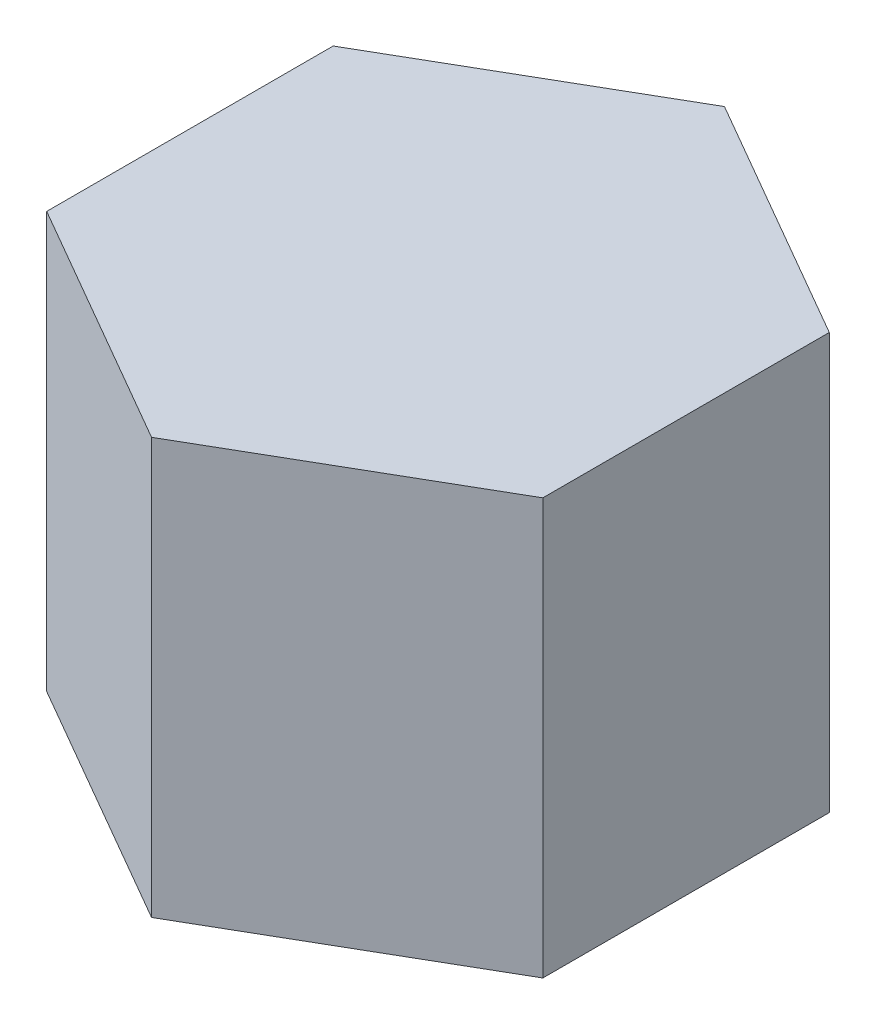
ISO-10303-21;
HEADER;
FILE_DESCRIPTION(('STEP AP214'),'2;1');
FILE_NAME('part.step','',(''),(''),'','','');
FILE_SCHEMA(('AUTOMOTIVE_DESIGN { 1 0 10303 214 1 1 1 1 }'));
ENDSEC;
DATA;
#1=APPLICATION_CONTEXT('core data for automotive mechanical design processes');
#2=APPLICATION_PROTOCOL_DEFINITION('international standard','automotive_design',2000,#1);
#3=PRODUCT_CONTEXT('',#1,'mechanical');
#4=PRODUCT('Part','Part','',(#3));
#5=PRODUCT_RELATED_PRODUCT_CATEGORY('part','',(#4));
#6=PRODUCT_DEFINITION_FORMATION('','',#4);
#7=PRODUCT_DEFINITION_CONTEXT('part definition',#1,'design');
#8=PRODUCT_DEFINITION('design','',#6,#7);
#9=PRODUCT_DEFINITION_SHAPE('','',#8);
#10=(LENGTH_UNIT() NAMED_UNIT(*) SI_UNIT(.MILLI.,.METRE.));
#11=(NAMED_UNIT(*) PLANE_ANGLE_UNIT() SI_UNIT($,.RADIAN.));
#12=(NAMED_UNIT(*) SI_UNIT($,.STERADIAN.) SOLID_ANGLE_UNIT());
#13=UNCERTAINTY_MEASURE_WITH_UNIT(LENGTH_MEASURE(1.E-05),#10,'distance_accuracy_value','');
#14=(GEOMETRIC_REPRESENTATION_CONTEXT(3) GLOBAL_UNCERTAINTY_ASSIGNED_CONTEXT((#13)) GLOBAL_UNIT_ASSIGNED_CONTEXT((#10,
#11,#12)) REPRESENTATION_CONTEXT('',''));
#15=CARTESIAN_POINT('',(0.,0.,0.));
#16=DIRECTION('',(0.,0.,1.));
#17=DIRECTION('',(1.,0.,0.));
#18=AXIS2_PLACEMENT_3D('',#15,#16,#17);
#19=CARTESIAN_POINT('',(204.142660308706,-148.537700895744,290.64094581671));
#20=DIRECTION('',(-0.499999999999909,0.,-0.866025403784491));
#21=DIRECTION('',(-0.866025403784491,0.,0.499999999999909));
#22=AXIS2_PLACEMENT_3D('',#19,#20,#21);
#23=PLANE('',#22);
#24=CARTESIAN_POINT('',(203.839551417382,-149.045793579175,290.81594581671));
#25=DIRECTION('',(0.866025403784491,0.,-0.499999999999909));
#26=VECTOR('',#25,1.);
#27=LINE('',#24,#26);
#28=CARTESIAN_POINT('',(203.839551417382,-149.045793579175,290.81594581671));
#29=VERTEX_POINT('',#28);
#30=CARTESIAN_POINT('',(204.142660308706,-149.045793579175,290.64094581671));
#31=VERTEX_POINT('',#30);
#32=EDGE_CURVE('E170',#29,#31,#27,.T.);
#33=ORIENTED_EDGE('',*,*,#32,.T.);
#34=CARTESIAN_POINT('',(204.142660308706,-148.537700895744,290.64094581671));
#35=DIRECTION('',(0.,-1.,0.));
#36=VECTOR('',#35,1.);
#37=LINE('',#34,#36);
#38=CARTESIAN_POINT('',(204.142660308706,-148.537700895744,290.64094581671));
#39=VERTEX_POINT('',#38);
#40=EDGE_CURVE('E35',#39,#31,#37,.T.);
#41=ORIENTED_EDGE('',*,*,#40,.F.);
#42=CARTESIAN_POINT('',(203.839551417382,-148.537700895744,290.81594581671));
#43=DIRECTION('',(0.866025403784491,0.,-0.499999999999909));
#44=VECTOR('',#43,1.);
#45=LINE('',#42,#44);
#46=CARTESIAN_POINT('',(203.839551417382,-148.537700895744,290.81594581671));
#47=VERTEX_POINT('',#46);
#48=EDGE_CURVE('E159',#47,#39,#45,.T.);
#49=ORIENTED_EDGE('',*,*,#48,.F.);
#50=CARTESIAN_POINT('',(203.839551417382,-148.537700895744,290.81594581671));
#51=DIRECTION('',(0.,-1.,0.));
#52=VECTOR('',#51,1.);
#53=LINE('',#50,#52);
#54=EDGE_CURVE('E10',#47,#29,#53,.T.);
#55=ORIENTED_EDGE('',*,*,#54,.T.);
#56=EDGE_LOOP('',(#33,#41,#49,#55));
#57=FACE_BOUND('',#56,.T.);
#58=ADVANCED_FACE('F16',(#57),#23,.F.);
#59=CARTESIAN_POINT('',(203.839551417382,-148.537700895744,290.81594581671));
#60=DIRECTION('',(0.500000000000062,0.,-0.866025403784403));
#61=DIRECTION('',(-0.866025403784403,0.,-0.500000000000062));
#62=AXIS2_PLACEMENT_3D('',#59,#60,#61);
#63=PLANE('',#62);
#64=CARTESIAN_POINT('',(203.536442526057,-149.045793579175,290.64094581671));
#65=DIRECTION('',(0.866025403784403,0.,0.500000000000062));
#66=VECTOR('',#65,1.);
#67=LINE('',#64,#66);
#68=CARTESIAN_POINT('',(203.536442526057,-149.045793579175,290.64094581671));
#69=VERTEX_POINT('',#68);
#70=EDGE_CURVE('E167',#69,#29,#67,.T.);
#71=ORIENTED_EDGE('',*,*,#70,.T.);
#72=ORIENTED_EDGE('',*,*,#54,.F.);
#73=CARTESIAN_POINT('',(203.536442526057,-148.537700895744,290.64094581671));
#74=DIRECTION('',(0.866025403784403,0.,0.500000000000062));
#75=VECTOR('',#74,1.);
#76=LINE('',#73,#75);
#77=CARTESIAN_POINT('',(203.536442526057,-148.537700895744,290.64094581671));
#78=VERTEX_POINT('',#77);
#79=EDGE_CURVE('E156',#78,#47,#76,.T.);
#80=ORIENTED_EDGE('',*,*,#79,.F.);
#81=CARTESIAN_POINT('',(203.536442526057,-148.537700895744,290.64094581671));
#82=DIRECTION('',(0.,-1.,0.));
#83=VECTOR('',#82,1.);
#84=LINE('',#81,#83);
#85=EDGE_CURVE('E27',#78,#69,#84,.T.);
#86=ORIENTED_EDGE('',*,*,#85,.T.);
#87=EDGE_LOOP('',(#71,#72,#80,#86));
#88=FACE_BOUND('',#87,.T.);
#89=ADVANCED_FACE('F189',(#88),#63,.F.);
#90=CARTESIAN_POINT('',(203.536442526057,-148.537700895744,290.831971220494));
#91=DIRECTION('',(1.,0.,0.));
#92=DIRECTION('',(0.,1.,0.));
#93=AXIS2_PLACEMENT_3D('',#90,#91,#92);
#94=PLANE('',#93);
#95=CARTESIAN_POINT('',(203.536442526057,-149.045793579175,290.29094581671));
#96=DIRECTION('',(0.,0.,1.));
#97=VECTOR('',#96,1.);
#98=LINE('',#95,#97);
#99=CARTESIAN_POINT('',(203.536442526057,-149.045793579175,290.29094581671));
#100=VERTEX_POINT('',#99);
#101=EDGE_CURVE('E163',#100,#69,#98,.T.);
#102=ORIENTED_EDGE('',*,*,#101,.T.);
#103=ORIENTED_EDGE('',*,*,#85,.F.);
#104=CARTESIAN_POINT('',(203.536442526057,-148.537700895744,290.29094581671));
#105=DIRECTION('',(0.,0.,1.));
#106=VECTOR('',#105,1.);
#107=LINE('',#104,#106);
#108=CARTESIAN_POINT('',(203.536442526057,-148.537700895744,290.29094581671));
#109=VERTEX_POINT('',#108);
#110=EDGE_CURVE('E106',#109,#78,#107,.T.);
#111=ORIENTED_EDGE('',*,*,#110,.F.);
#112=CARTESIAN_POINT('',(203.536442526057,-148.537700895744,290.29094581671));
#113=DIRECTION('',(0.,-1.,0.));
#114=VECTOR('',#113,1.);
#115=LINE('',#112,#114);
#116=EDGE_CURVE('E94',#109,#100,#115,.T.);
#117=ORIENTED_EDGE('',*,*,#116,.T.);
#118=EDGE_LOOP('',(#102,#103,#111,#117));
#119=FACE_BOUND('',#118,.T.);
#120=ADVANCED_FACE('F198',(#119),#94,.F.);
#121=CARTESIAN_POINT('',(203.536442526057,-148.537700895744,290.29094581671));
#122=DIRECTION('',(0.499999999999943,0.,0.866025403784472));
#123=DIRECTION('',(0.866025403784472,0.,-0.499999999999943));
#124=AXIS2_PLACEMENT_3D('',#121,#122,#123);
#125=PLANE('',#124);
#126=CARTESIAN_POINT('',(203.839551417382,-149.045793579175,290.11594581671));
#127=DIRECTION('',(-0.866025403784471,0.,0.499999999999943));
#128=VECTOR('',#127,1.);
#129=LINE('',#126,#128);
#130=CARTESIAN_POINT('',(203.839551417382,-149.045793579175,290.11594581671));
#131=VERTEX_POINT('',#130);
#132=EDGE_CURVE('E162',#131,#100,#129,.T.);
#133=ORIENTED_EDGE('',*,*,#132,.T.);
#134=ORIENTED_EDGE('',*,*,#116,.F.);
#135=CARTESIAN_POINT('',(203.839551417382,-148.537700895744,290.11594581671));
#136=DIRECTION('',(-0.866025403784471,0.,0.499999999999943));
#137=VECTOR('',#136,1.);
#138=LINE('',#135,#137);
#139=CARTESIAN_POINT('',(203.839551417382,-148.537700895744,290.11594581671));
#140=VERTEX_POINT('',#139);
#141=EDGE_CURVE('E98',#140,#109,#138,.T.);
#142=ORIENTED_EDGE('',*,*,#141,.F.);
#143=CARTESIAN_POINT('',(203.839551417382,-148.537700895744,290.11594581671));
#144=DIRECTION('',(0.,-1.,0.));
#145=VECTOR('',#144,1.);
#146=LINE('',#143,#145);
#147=EDGE_CURVE('E79',#140,#131,#146,.T.);
#148=ORIENTED_EDGE('',*,*,#147,.T.);
#149=EDGE_LOOP('',(#133,#134,#142,#148));
#150=FACE_BOUND('',#149,.T.);
#151=ADVANCED_FACE('F100',(#150),#125,.F.);
#152=CARTESIAN_POINT('',(203.839551417381,-148.537700895744,290.11594581671));
#153=DIRECTION('',(-0.500000000000062,0.,0.866025403784403));
#154=DIRECTION('',(0.866025403784403,0.,0.500000000000062));
#155=AXIS2_PLACEMENT_3D('',#152,#153,#154);
#156=PLANE('',#155);
#157=CARTESIAN_POINT('',(204.142660308706,-149.045793579175,290.29094581671));
#158=DIRECTION('',(-0.866025403784403,0.,-0.500000000000062));
#159=VECTOR('',#158,1.);
#160=LINE('',#157,#159);
#161=CARTESIAN_POINT('',(204.142660308706,-149.045793579175,290.29094581671));
#162=VERTEX_POINT('',#161);
#163=EDGE_CURVE('E88',#162,#131,#160,.T.);
#164=ORIENTED_EDGE('',*,*,#163,.T.);
#165=ORIENTED_EDGE('',*,*,#147,.F.);
#166=CARTESIAN_POINT('',(204.142660308706,-148.537700895744,290.29094581671));
#167=DIRECTION('',(-0.866025403784403,0.,-0.500000000000062));
#168=VECTOR('',#167,1.);
#169=LINE('',#166,#168);
#170=CARTESIAN_POINT('',(204.142660308706,-148.537700895744,290.29094581671));
#171=VERTEX_POINT('',#170);
#172=EDGE_CURVE('E84',#171,#140,#169,.T.);
#173=ORIENTED_EDGE('',*,*,#172,.F.);
#174=CARTESIAN_POINT('',(204.142660308706,-148.537700895744,290.29094581671));
#175=DIRECTION('',(0.,-1.,0.));
#176=VECTOR('',#175,1.);
#177=LINE('',#174,#176);
#178=EDGE_CURVE('E58',#171,#162,#177,.T.);
#179=ORIENTED_EDGE('',*,*,#178,.T.);
#180=EDGE_LOOP('',(#164,#165,#173,#179));
#181=FACE_BOUND('',#180,.T.);
#182=ADVANCED_FACE('F82',(#181),#156,.F.);
#183=CARTESIAN_POINT('',(204.142660308706,-148.537700895744,290.831971220494));
#184=DIRECTION('',(-1.,0.,0.));
#185=DIRECTION('',(0.,-1.,0.));
#186=AXIS2_PLACEMENT_3D('',#183,#184,#185);
#187=PLANE('',#186);
#188=CARTESIAN_POINT('',(204.142660308706,-149.045793579175,290.64094581671));
#189=DIRECTION('',(0.,0.,-1.));
#190=VECTOR('',#189,1.);
#191=LINE('',#188,#190);
#192=EDGE_CURVE('E160',#31,#162,#191,.T.);
#193=ORIENTED_EDGE('',*,*,#192,.T.);
#194=ORIENTED_EDGE('',*,*,#178,.F.);
#195=CARTESIAN_POINT('',(204.142660308706,-148.537700895744,290.64094581671));
#196=DIRECTION('',(0.,0.,-1.));
#197=VECTOR('',#196,1.);
#198=LINE('',#195,#197);
#199=EDGE_CURVE('E112',#39,#171,#198,.T.);
#200=ORIENTED_EDGE('',*,*,#199,.F.);
#201=ORIENTED_EDGE('',*,*,#40,.T.);
#202=EDGE_LOOP('',(#193,#194,#200,#201));
#203=FACE_BOUND('',#202,.T.);
#204=ADVANCED_FACE('F131',(#203),#187,.F.);
#205=CARTESIAN_POINT('',(206.339551417382,-148.537700895744,290.831971220494));
#206=DIRECTION('',(0.,-1.,0.));
#207=DIRECTION('',(1.,0.,0.));
#208=AXIS2_PLACEMENT_3D('',#205,#206,#207);
#209=PLANE('',#208);
#210=ORIENTED_EDGE('',*,*,#48,.T.);
#211=ORIENTED_EDGE('',*,*,#199,.T.);
#212=ORIENTED_EDGE('',*,*,#172,.T.);
#213=ORIENTED_EDGE('',*,*,#141,.T.);
#214=ORIENTED_EDGE('',*,*,#110,.T.);
#215=ORIENTED_EDGE('',*,*,#79,.T.);
#216=EDGE_LOOP('',(#210,#211,#212,#213,#214,#215));
#217=FACE_BOUND('',#216,.T.);
#218=ADVANCED_FACE('F111',(#217),#209,.F.);
#219=CARTESIAN_POINT('',(206.339551417382,-149.045793579175,290.831971220494));
#220=DIRECTION('',(0.,-1.,0.));
#221=DIRECTION('',(1.,0.,0.));
#222=AXIS2_PLACEMENT_3D('',#219,#220,#221);
#223=PLANE('',#222);
#224=ORIENTED_EDGE('',*,*,#32,.F.);
#225=ORIENTED_EDGE('',*,*,#70,.F.);
#226=ORIENTED_EDGE('',*,*,#101,.F.);
#227=ORIENTED_EDGE('',*,*,#132,.F.);
#228=ORIENTED_EDGE('',*,*,#163,.F.);
#229=ORIENTED_EDGE('',*,*,#192,.F.);
#230=EDGE_LOOP('',(#224,#225,#226,#227,#228,#229));
#231=FACE_BOUND('',#230,.T.);
#232=ADVANCED_FACE('F130',(#231),#223,.T.);
#233=CLOSED_SHELL('',(#58,#89,#120,#151,#182,#204,#218,#232));
#234=MANIFOLD_SOLID_BREP('B1',#233);
#235=ADVANCED_BREP_SHAPE_REPRESENTATION('',(#18,#234),#14);
#236=SHAPE_DEFINITION_REPRESENTATION(#9,#235);
ENDSEC;
END-ISO-10303-21;
